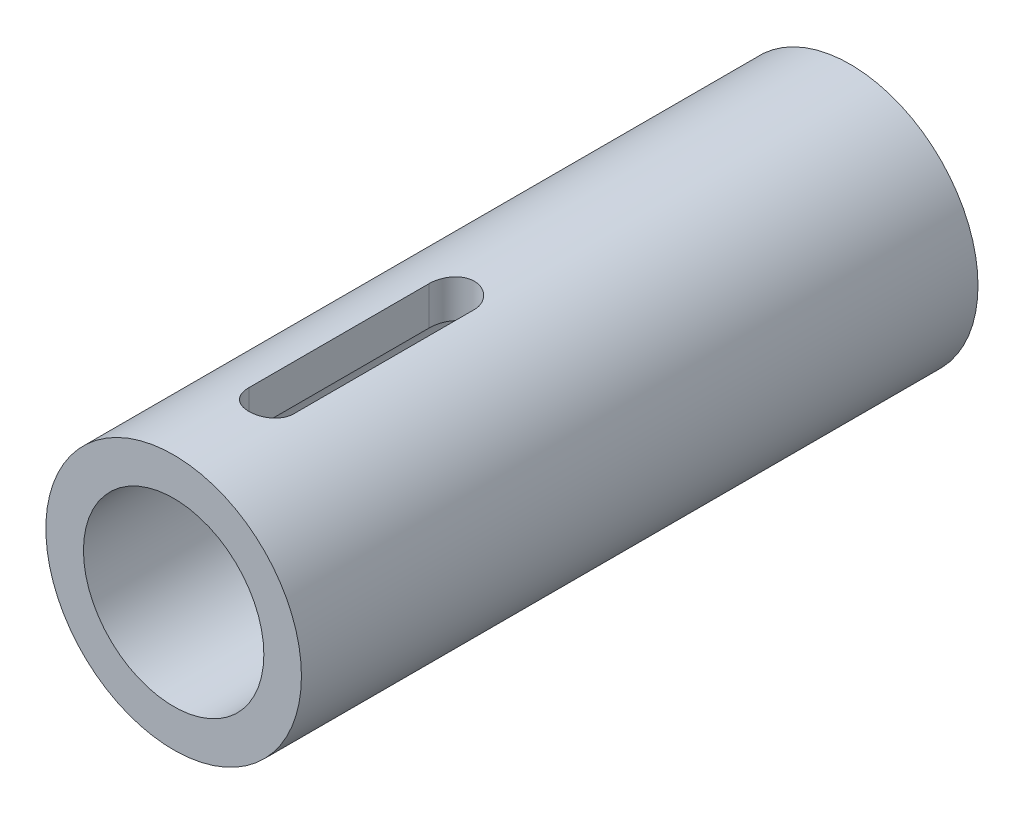
ISO-10303-21;
HEADER;
FILE_DESCRIPTION(('STEP AP214'),'2;1');
FILE_NAME('part.step','',(''),(''),'','','');
FILE_SCHEMA(('AUTOMOTIVE_DESIGN { 1 0 10303 214 1 1 1 1 }'));
ENDSEC;
DATA;
#1=APPLICATION_CONTEXT('core data for automotive mechanical design processes');
#2=APPLICATION_PROTOCOL_DEFINITION('international standard','automotive_design',2000,#1);
#3=PRODUCT_CONTEXT('',#1,'mechanical');
#4=PRODUCT('Part','Part','',(#3));
#5=PRODUCT_RELATED_PRODUCT_CATEGORY('part','',(#4));
#6=PRODUCT_DEFINITION_FORMATION('','',#4);
#7=PRODUCT_DEFINITION_CONTEXT('part definition',#1,'design');
#8=PRODUCT_DEFINITION('design','',#6,#7);
#9=PRODUCT_DEFINITION_SHAPE('','',#8);
#10=(LENGTH_UNIT() NAMED_UNIT(*) SI_UNIT(.MILLI.,.METRE.));
#11=(NAMED_UNIT(*) PLANE_ANGLE_UNIT() SI_UNIT($,.RADIAN.));
#12=(NAMED_UNIT(*) SI_UNIT($,.STERADIAN.) SOLID_ANGLE_UNIT());
#13=UNCERTAINTY_MEASURE_WITH_UNIT(LENGTH_MEASURE(1.E-05),#10,'distance_accuracy_value','');
#14=(GEOMETRIC_REPRESENTATION_CONTEXT(3) GLOBAL_UNCERTAINTY_ASSIGNED_CONTEXT((#13)) GLOBAL_UNIT_ASSIGNED_CONTEXT((#10,
#11,#12)) REPRESENTATION_CONTEXT('',''));
#15=CARTESIAN_POINT('',(0.,0.,0.));
#16=DIRECTION('',(0.,0.,1.));
#17=DIRECTION('',(1.,0.,0.));
#18=AXIS2_PLACEMENT_3D('',#15,#16,#17);
#19=CARTESIAN_POINT('',(0.,0.,45.));
#20=DIRECTION('',(0.,0.,1.));
#21=DIRECTION('',(1.,0.,0.));
#22=AXIS2_PLACEMENT_3D('',#19,#20,#21);
#23=PLANE('',#22);
#24=CARTESIAN_POINT('',(0.,0.,45.));
#25=DIRECTION('',(0.,0.,1.));
#26=DIRECTION('',(1.,0.,0.));
#27=AXIS2_PLACEMENT_3D('',#24,#25,#26);
#28=CIRCLE('',#27,8.5);
#29=CARTESIAN_POINT('',(8.5,0.,45.));
#30=VERTEX_POINT('',#29);
#31=EDGE_CURVE('E11',#30,#30,#28,.T.);
#32=ORIENTED_EDGE('',*,*,#31,.T.);
#33=EDGE_LOOP('',(#32));
#34=FACE_BOUND('',#33,.T.);
#35=CARTESIAN_POINT('',(0.,0.,45.));
#36=DIRECTION('',(0.,0.,1.));
#37=DIRECTION('',(1.,0.,0.));
#38=AXIS2_PLACEMENT_3D('',#35,#36,#37);
#39=CIRCLE('',#38,6.);
#40=CARTESIAN_POINT('',(6.,0.,45.));
#41=VERTEX_POINT('',#40);
#42=EDGE_CURVE('E137',#41,#41,#39,.T.);
#43=ORIENTED_EDGE('',*,*,#42,.F.);
#44=EDGE_LOOP('',(#43));
#45=FACE_BOUND('',#44,.T.);
#46=ADVANCED_FACE('F31',(#34,#45),#23,.T.);
#47=CARTESIAN_POINT('',(0.,0.,0.));
#48=DIRECTION('',(0.,0.,1.));
#49=DIRECTION('',(1.,0.,0.));
#50=AXIS2_PLACEMENT_3D('',#47,#48,#49);
#51=PLANE('',#50);
#52=CARTESIAN_POINT('',(0.,0.,0.));
#53=DIRECTION('',(0.,0.,1.));
#54=DIRECTION('',(1.,0.,0.));
#55=AXIS2_PLACEMENT_3D('',#52,#53,#54);
#56=CIRCLE('',#55,8.5);
#57=CARTESIAN_POINT('',(8.5,0.,0.));
#58=VERTEX_POINT('',#57);
#59=EDGE_CURVE('E35',#58,#58,#56,.T.);
#60=ORIENTED_EDGE('',*,*,#59,.F.);
#61=EDGE_LOOP('',(#60));
#62=FACE_BOUND('',#61,.T.);
#63=CARTESIAN_POINT('',(0.,0.,0.));
#64=DIRECTION('',(0.,0.,1.));
#65=DIRECTION('',(1.,0.,0.));
#66=AXIS2_PLACEMENT_3D('',#63,#64,#65);
#67=CIRCLE('',#66,6.);
#68=CARTESIAN_POINT('',(6.,0.,0.));
#69=VERTEX_POINT('',#68);
#70=EDGE_CURVE('E136',#69,#69,#67,.T.);
#71=ORIENTED_EDGE('',*,*,#70,.T.);
#72=EDGE_LOOP('',(#71));
#73=FACE_BOUND('',#72,.T.);
#74=ADVANCED_FACE('F143',(#62,#73),#51,.F.);
#75=CARTESIAN_POINT('',(0.,0.,45.));
#76=DIRECTION('',(0.,0.,-1.));
#77=DIRECTION('',(-1.,0.,0.));
#78=AXIS2_PLACEMENT_3D('',#75,#76,#77);
#79=CYLINDRICAL_SURFACE('',#78,8.5);
#80=CARTESIAN_POINT('',(1.5,8.36660026534076,26.5));
#81=CARTESIAN_POINT('',(1.50000011135859,8.366598402778,26.4581493818495));
#82=CARTESIAN_POINT('',(1.4982474179413,8.36691467710197,26.4163191412351));
#83=CARTESIAN_POINT('',(1.49125777827606,8.3681640106607,26.3329645220983));
#84=CARTESIAN_POINT('',(1.48602120328377,8.36909700417546,26.2914401114623));
#85=CARTESIAN_POINT('',(1.46514818179087,8.37278645036765,26.1678936386286));
#86=CARTESIAN_POINT('',(1.44434821617835,8.37643353972846,26.0867094820502));
#87=CARTESIAN_POINT('',(1.38960356269488,8.38568796416279,25.9290561356252));
#88=CARTESIAN_POINT('',(1.35565638132934,8.39129567106646,25.8525878433783));
#89=CARTESIAN_POINT('',(1.27560337342705,8.40383672205726,25.7064152438002));
#90=CARTESIAN_POINT('',(1.22949708426408,8.41077011658101,25.636711193971));
#91=CARTESIAN_POINT('',(1.12590102963337,8.42526563496412,25.5053059178189));
#92=CARTESIAN_POINT('',(1.0683044492113,8.43283323966683,25.4436895319723));
#93=CARTESIAN_POINT('',(0.943586837078766,8.44769677126336,25.3309355665241));
#94=CARTESIAN_POINT('',(0.876464344340724,8.45499265626536,25.2797995972922));
#95=CARTESIAN_POINT('',(0.734046276801383,8.46854880703508,25.1891421565387));
#96=CARTESIAN_POINT('',(0.658698947327548,8.47480180537148,25.1497008114296));
#97=CARTESIAN_POINT('',(0.502323494924654,8.48550558844895,25.0840694640184));
#98=CARTESIAN_POINT('',(0.421296106217059,8.48995660561739,25.057877752612));
#99=CARTESIAN_POINT('',(0.256742997836217,8.49651635854217,25.0197492836171));
#100=CARTESIAN_POINT('',(0.173251637296258,8.49864876385664,25.0076683795436));
#101=CARTESIAN_POINT('',(0.00539963868181817,8.500412496163,24.9976557245214));
#102=CARTESIAN_POINT('',(-0.0789609537482993,8.50004395382093,24.9997232343661));
#103=CARTESIAN_POINT('',(-0.245165496187647,8.49686584828589,25.0178376812364));
#104=CARTESIAN_POINT('',(-0.327026991878545,8.49408344494614,25.0337290824281));
#105=CARTESIAN_POINT('',(-0.486902434331634,8.48642063738551,25.0787947030915));
#106=CARTESIAN_POINT('',(-0.564916278540462,8.48154017727773,25.1079692763943));
#107=CARTESIAN_POINT('',(-0.715341078171811,8.47018366749821,25.1789252548035));
#108=CARTESIAN_POINT('',(-0.787721485002882,8.46369962061736,25.2207700895613));
#109=CARTESIAN_POINT('',(-0.92448899546238,8.44985515876235,25.3158307810456));
#110=CARTESIAN_POINT('',(-0.988875661861379,8.44249469589443,25.369047259328));
#111=CARTESIAN_POINT('',(-1.10874335222035,8.42759704414416,25.4861926773927));
#112=CARTESIAN_POINT('',(-1.16409268396565,8.4200588103546,25.5502563027149));
#113=CARTESIAN_POINT('',(-1.26329447706803,8.40574849793007,25.6868507425594));
#114=CARTESIAN_POINT('',(-1.3071436909601,8.39897663601356,25.7593839404262));
#115=CARTESIAN_POINT('',(-1.38213228465011,8.38696375335457,25.9110316240987));
#116=CARTESIAN_POINT('',(-1.41324691775275,8.38172571881351,25.9901585677274));
#117=CARTESIAN_POINT('',(-1.46166112850799,8.37341986972631,26.152576139506));
#118=CARTESIAN_POINT('',(-1.47898133268701,8.37034881572577,26.235860352448));
#119=CARTESIAN_POINT('',(-1.49276888438618,8.36789388231905,26.3498225776212));
#120=CARTESIAN_POINT('',(-1.49548163450041,8.36740923587787,26.3798183824869));
#121=CARTESIAN_POINT('',(-1.49909485472849,8.36676273838412,26.4398717139494));
#122=CARTESIAN_POINT('',(-1.4999983711754,8.36660034473619,26.4699290513493));
#123=CARTESIAN_POINT('',(-1.5,8.36660026534075,26.5));
#124=B_SPLINE_CURVE_WITH_KNOTS('',3,(#80,#81,#82,#83,#84,#85,#86,#87,#88,#89,#90,#91,#92,#93,
#94,#95,#96,#97,#98,#99,#100,#101,#102,#103,#104,#105,#106,#107,#108,#109,#110,#111,#112,#113,
#114,#115,#116,#117,#118,#119,#120,#121,#122,#123),.UNSPECIFIED.,.F.,.F.,(4,2,2,2,2,2,2,2,2,2,2,
2,2,2,2,2,2,2,2,2,2,4),(0.,0.125473687190875,0.250934005570584,0.501295383099465,
0.751704267317939,1.00212268039609,1.25498766631627,1.50789147715663,1.76249002695643,
2.01705572705567,2.26899756033392,2.52092623060524,2.77005652657743,3.0191934591585,
3.26959883743158,3.52001790596794,3.77381131576282,4.02767631612482,4.28203232814816,
4.53600728901199,4.62633117846913,4.71650285497248),.UNSPECIFIED.);
#125=CARTESIAN_POINT('',(1.5,8.36660026534075,26.5));
#126=VERTEX_POINT('',#125);
#127=CARTESIAN_POINT('',(-1.5,8.36660026534076,26.5));
#128=VERTEX_POINT('',#127);
#129=EDGE_CURVE('E78',#126,#128,#124,.T.);
#130=ORIENTED_EDGE('',*,*,#129,.F.);
#131=DIRECTION('',(0.,0.,-1.));
#132=VECTOR('',#131,1.);
#133=CARTESIAN_POINT('',(1.5,8.36660026534075,45.));
#134=LINE('',#133,#132);
#135=CARTESIAN_POINT('',(1.5,8.36660026534075,38.5));
#136=VERTEX_POINT('',#135);
#137=EDGE_CURVE('E86',#136,#126,#134,.T.);
#138=ORIENTED_EDGE('',*,*,#137,.F.);
#139=CARTESIAN_POINT('',(-1.5,8.36660026534076,38.5));
#140=CARTESIAN_POINT('',(-1.50000011135859,8.366598402778,38.5418506181505));
#141=CARTESIAN_POINT('',(-1.4982474179413,8.36691467710197,38.5836808587649));
#142=CARTESIAN_POINT('',(-1.49125777827606,8.3681640106607,38.6670354779017));
#143=CARTESIAN_POINT('',(-1.48602120328377,8.36909700417546,38.7085598885377));
#144=CARTESIAN_POINT('',(-1.46514818179087,8.37278645036765,38.8321063613714));
#145=CARTESIAN_POINT('',(-1.44434821617835,8.37643353972846,38.9132905179498));
#146=CARTESIAN_POINT('',(-1.38960356269488,8.38568796416279,39.0709438643748));
#147=CARTESIAN_POINT('',(-1.35565638132935,8.39129567106646,39.1474121566217));
#148=CARTESIAN_POINT('',(-1.27560337342705,8.40383672205726,39.2935847561998));
#149=CARTESIAN_POINT('',(-1.22949708426408,8.41077011658101,39.363288806029));
#150=CARTESIAN_POINT('',(-1.12590102963337,8.42526563496412,39.4946940821811));
#151=CARTESIAN_POINT('',(-1.0683044492113,8.43283323966683,39.5563104680277));
#152=CARTESIAN_POINT('',(-0.943586837078763,8.44769677126336,39.6690644334759));
#153=CARTESIAN_POINT('',(-0.876464344340719,8.45499265626536,39.7202004027078));
#154=CARTESIAN_POINT('',(-0.734046276801379,8.46854880703508,39.8108578434613));
#155=CARTESIAN_POINT('',(-0.658698947327544,8.47480180537148,39.8502991885704));
#156=CARTESIAN_POINT('',(-0.502323494924653,8.48550558844895,39.9159305359816));
#157=CARTESIAN_POINT('',(-0.421296106217059,8.48995660561739,39.942122247388));
#158=CARTESIAN_POINT('',(-0.256742997836217,8.49651635854217,39.9802507163829));
#159=CARTESIAN_POINT('',(-0.173251637296258,8.49864876385664,39.9923316204564));
#160=CARTESIAN_POINT('',(-0.00539963868181676,8.500412496163,40.0023442754786));
#161=CARTESIAN_POINT('',(0.0789609537483017,8.50004395382093,40.0002767656339));
#162=CARTESIAN_POINT('',(0.245165496187651,8.49686584828589,39.9821623187636));
#163=CARTESIAN_POINT('',(0.327026991878549,8.49408344494614,39.9662709175719));
#164=CARTESIAN_POINT('',(0.486902434331638,8.48642063738551,39.9212052969085));
#165=CARTESIAN_POINT('',(0.564916278540465,8.48154017727773,39.8920307236057));
#166=CARTESIAN_POINT('',(0.715341078171813,8.47018366749821,39.8210747451965));
#167=CARTESIAN_POINT('',(0.787721485002885,8.46369962061736,39.7792299104387));
#168=CARTESIAN_POINT('',(0.924488995462384,8.44985515876235,39.6841692189544));
#169=CARTESIAN_POINT('',(0.988875661861384,8.44249469589442,39.630952740672));
#170=CARTESIAN_POINT('',(1.10874335222035,8.42759704414415,39.5138073226073));
#171=CARTESIAN_POINT('',(1.16409268396565,8.4200588103546,39.4497436972851));
#172=CARTESIAN_POINT('',(1.26329447706803,8.40574849793007,39.3131492574406));
#173=CARTESIAN_POINT('',(1.3071436909601,8.39897663601356,39.2406160595738));
#174=CARTESIAN_POINT('',(1.38213228465011,8.38696375335457,39.0889683759013));
#175=CARTESIAN_POINT('',(1.41324691775275,8.38172571881351,39.0098414322726));
#176=CARTESIAN_POINT('',(1.46166112850799,8.37341986972631,38.847423860494));
#177=CARTESIAN_POINT('',(1.47898133268701,8.37034881572577,38.764139647552));
#178=CARTESIAN_POINT('',(1.49276888438618,8.36789388231905,38.6501774223788));
#179=CARTESIAN_POINT('',(1.49548163450041,8.36740923587787,38.6201816175131));
#180=CARTESIAN_POINT('',(1.49909485472849,8.36676273838412,38.5601282860505));
#181=CARTESIAN_POINT('',(1.4999983711754,8.36660034473619,38.5300709486507));
#182=CARTESIAN_POINT('',(1.5,8.36660026534075,38.5));
#183=B_SPLINE_CURVE_WITH_KNOTS('',3,(#139,#140,#141,#142,#143,#144,#145,#146,#147,#148,#149,
#150,#151,#152,#153,#154,#155,#156,#157,#158,#159,#160,#161,#162,#163,#164,#165,#166,#167,#168,
#169,#170,#171,#172,#173,#174,#175,#176,#177,#178,#179,#180,#181,#182),.UNSPECIFIED.,.F.,.F.,(4,
2,2,2,2,2,2,2,2,2,2,2,2,2,2,2,2,2,2,2,2,4),(0.,0.125473687190871,0.250934005570585,
0.501295383099468,0.751704267317934,1.00212268039609,1.25498766631627,1.50789147715664,
1.76249002695644,2.01705572705567,2.26899756033392,2.52092623060524,2.77005652657743,
3.0191934591585,3.26959883743159,3.52001790596794,3.77381131576283,4.02767631612483,
4.28203232814817,4.536007289012,4.62633117846913,4.71650285497248),.UNSPECIFIED.);
#184=CARTESIAN_POINT('',(-1.5,8.36660026534076,38.5));
#185=VERTEX_POINT('',#184);
#186=EDGE_CURVE('E90',#185,#136,#183,.T.);
#187=ORIENTED_EDGE('',*,*,#186,.F.);
#188=DIRECTION('',(0.,0.,-1.));
#189=VECTOR('',#188,1.);
#190=CARTESIAN_POINT('',(-1.5,8.36660026534075,45.));
#191=LINE('',#190,#189);
#192=EDGE_CURVE('E46',#128,#185,#191,.F.);
#193=ORIENTED_EDGE('',*,*,#192,.F.);
#194=EDGE_LOOP('',(#130,#138,#187,#193));
#195=FACE_BOUND('',#194,.T.);
#196=ORIENTED_EDGE('',*,*,#31,.F.);
#197=EDGE_LOOP('',(#196));
#198=FACE_BOUND('',#197,.T.);
#199=ORIENTED_EDGE('',*,*,#59,.T.);
#200=EDGE_LOOP('',(#199));
#201=FACE_BOUND('',#200,.T.);
#202=ADVANCED_FACE('F33',(#195,#198,#201),#79,.T.);
#203=CARTESIAN_POINT('',(0.,0.,45.));
#204=DIRECTION('',(0.,0.,-1.));
#205=DIRECTION('',(-1.,0.,0.));
#206=AXIS2_PLACEMENT_3D('',#203,#204,#205);
#207=CYLINDRICAL_SURFACE('',#206,6.);
#208=DIRECTION('',(0.,0.,-1.));
#209=VECTOR('',#208,1.);
#210=CARTESIAN_POINT('',(1.5,5.80947501931113,45.));
#211=LINE('',#210,#209);
#212=CARTESIAN_POINT('',(1.5,5.80947501931113,38.5));
#213=VERTEX_POINT('',#212);
#214=CARTESIAN_POINT('',(1.5,5.80947501931113,26.5));
#215=VERTEX_POINT('',#214);
#216=EDGE_CURVE('E132',#213,#215,#211,.T.);
#217=ORIENTED_EDGE('',*,*,#216,.T.);
#218=CARTESIAN_POINT('',(1.5,5.80947501931113,26.5));
#219=CARTESIAN_POINT('',(1.50000050624417,5.80947222870266,26.4585055223402));
#220=CARTESIAN_POINT('',(1.49827711106305,5.80992014924206,26.4170316054727));
#221=CARTESIAN_POINT('',(1.49140694309363,5.81168857161838,26.3343939470447));
#222=CARTESIAN_POINT('',(1.48626074635902,5.8130089266253,26.2932301544694));
#223=CARTESIAN_POINT('',(1.46576285907379,5.81822566458081,26.1708202401867));
#224=CARTESIAN_POINT('',(1.44535154275874,5.82337804723214,26.0904152972767));
#225=CARTESIAN_POINT('',(1.39169711437199,5.83643133882004,25.934312989327));
#226=CARTESIAN_POINT('',(1.35845520813575,5.84433198946395,25.8586151826807));
#227=CARTESIAN_POINT('',(1.2801230670388,5.86198701707909,25.713832827029));
#228=CARTESIAN_POINT('',(1.2350296550354,5.87174189093471,25.6447500581635));
#229=CARTESIAN_POINT('',(1.1332267077421,5.89224393597038,25.5136841771408));
#230=CARTESIAN_POINT('',(1.07630590317596,5.90300686543374,25.4518676706317));
#231=CARTESIAN_POINT('',(0.952913670774344,5.9241765659429,25.3385468657759));
#232=CARTESIAN_POINT('',(0.886440719218247,5.93458327983806,25.2870442157981));
#233=CARTESIAN_POINT('',(0.744685349102537,5.95404273424872,25.195133497572));
#234=CARTESIAN_POINT('',(0.669293010501711,5.96307457022596,25.154890156024));
#235=CARTESIAN_POINT('',(0.512553886264378,5.97858519375883,25.0877128987049));
#236=CARTESIAN_POINT('',(0.431208276124513,5.98506448372051,25.0607763635503));
#237=CARTESIAN_POINT('',(0.266616162787738,5.99462850007692,25.0215115108338));
#238=CARTESIAN_POINT('',(0.183441483004285,5.99777929351951,25.0088984913658));
#239=CARTESIAN_POINT('',(0.016099163522518,6.00056157226223,24.9977449426851));
#240=CARTESIAN_POINT('',(-0.0680683500430595,6.00019349990167,24.9992026447115));
#241=CARTESIAN_POINT('',(-0.233028739458145,5.99602856048604,25.0159449455282));
#242=CARTESIAN_POINT('',(-0.313855052609783,5.99230798016041,25.0309219248992));
#243=CARTESIAN_POINT('',(-0.47180806662651,5.98194495954744,25.0737830187741));
#244=CARTESIAN_POINT('',(-0.548934603635982,5.97530238998334,25.1016677043529));
#245=CARTESIAN_POINT('',(-0.69811092903681,5.95972496642698,25.169801921006));
#246=CARTESIAN_POINT('',(-0.770108444403374,5.95076990741333,25.2101610913493));
#247=CARTESIAN_POINT('',(-0.906414946845023,5.93153918312879,25.3020146947502));
#248=CARTESIAN_POINT('',(-0.970722773343435,5.92126331899798,25.3535108053798));
#249=CARTESIAN_POINT('',(-1.09165408456274,5.90018349034298,25.467818368122));
#250=CARTESIAN_POINT('',(-1.14802365458119,5.88937275716528,25.5308974548097));
#251=CARTESIAN_POINT('',(-1.24945436277936,5.8686925242601,25.6657448003916));
#252=CARTESIAN_POINT('',(-1.29451240536759,5.8588232826449,25.7375154299253));
#253=CARTESIAN_POINT('',(-1.37220706392894,5.84111720379488,25.8882183967356));
#254=CARTESIAN_POINT('',(-1.4047755268309,5.83329159013705,25.9671871973441));
#255=CARTESIAN_POINT('',(-1.45605352777474,5.82070588210583,26.1296753926274));
#256=CARTESIAN_POINT('',(-1.4747837838182,5.81594120642153,26.2131877827248));
#257=CARTESIAN_POINT('',(-1.49085695272641,5.81182936022286,26.3311860711384));
#258=CARTESIAN_POINT('',(-1.49428618645006,5.81094784666289,26.3648795548198));
#259=CARTESIAN_POINT('',(-1.49885513654609,5.80977093733462,26.432376684864));
#260=CARTESIAN_POINT('',(-1.49999855714407,5.80947459329191,26.4661800639329));
#261=CARTESIAN_POINT('',(-1.5,5.80947501931113,26.5));
#262=B_SPLINE_CURVE_WITH_KNOTS('',3,(#218,#219,#220,#221,#222,#223,#224,#225,#226,#227,#228,
#229,#230,#231,#232,#233,#234,#235,#236,#237,#238,#239,#240,#241,#242,#243,#244,#245,#246,#247,
#248,#249,#250,#251,#252,#253,#254,#255,#256,#257,#258,#259,#260,#261),.UNSPECIFIED.,.F.,.F.,(4,
2,2,2,2,2,2,2,2,2,2,2,2,2,2,2,2,2,2,2,2,4),(0.,0.124404795509654,0.248788659126978,
0.496844944620475,0.74487792313725,0.992977462090123,1.24596284614196,1.49898863030879,
1.75554280647352,2.01204646098637,2.26335722272987,2.51463639384958,2.76033818218913,
3.00605084213757,3.25398764175565,3.50196181446493,3.75662144301813,4.01135068771451,
4.26745080241601,4.52316671309979,4.62473773083972,4.72614401597507),.UNSPECIFIED.);
#263=CARTESIAN_POINT('',(-1.5,5.80947501931113,26.5));
#264=VERTEX_POINT('',#263);
#265=EDGE_CURVE('E80',#215,#264,#262,.T.);
#266=ORIENTED_EDGE('',*,*,#265,.T.);
#267=DIRECTION('',(0.,0.,-1.));
#268=VECTOR('',#267,1.);
#269=CARTESIAN_POINT('',(-1.5,5.80947501931113,45.));
#270=LINE('',#269,#268);
#271=CARTESIAN_POINT('',(-1.5,5.80947501931113,38.5));
#272=VERTEX_POINT('',#271);
#273=EDGE_CURVE('E94',#264,#272,#270,.F.);
#274=ORIENTED_EDGE('',*,*,#273,.T.);
#275=CARTESIAN_POINT('',(-1.5,5.80947501931113,38.5));
#276=CARTESIAN_POINT('',(-1.50000050624417,5.80947222870266,38.5414944776598));
#277=CARTESIAN_POINT('',(-1.49827711106305,5.80992014924206,38.5829683945273));
#278=CARTESIAN_POINT('',(-1.49140694309363,5.81168857161838,38.6656060529553));
#279=CARTESIAN_POINT('',(-1.48626074635902,5.8130089266253,38.7067698455306));
#280=CARTESIAN_POINT('',(-1.46576285907379,5.81822566458081,38.8291797598133));
#281=CARTESIAN_POINT('',(-1.44535154275874,5.82337804723213,38.9095847027233));
#282=CARTESIAN_POINT('',(-1.391697114372,5.83643133882004,39.065687010673));
#283=CARTESIAN_POINT('',(-1.35845520813576,5.84433198946395,39.1413848173193));
#284=CARTESIAN_POINT('',(-1.2801230670388,5.86198701707909,39.286167172971));
#285=CARTESIAN_POINT('',(-1.2350296550354,5.8717418909347,39.3552499418364));
#286=CARTESIAN_POINT('',(-1.13322670774211,5.89224393597038,39.4863158228591));
#287=CARTESIAN_POINT('',(-1.07630590317596,5.90300686543374,39.5481323293683));
#288=CARTESIAN_POINT('',(-0.952913670774346,5.9241765659429,39.6614531342241));
#289=CARTESIAN_POINT('',(-0.886440719218248,5.93458327983806,39.7129557842019));
#290=CARTESIAN_POINT('',(-0.744685349102537,5.95404273424872,39.804866502428));
#291=CARTESIAN_POINT('',(-0.669293010501711,5.96307457022596,39.845109843976));
#292=CARTESIAN_POINT('',(-0.512553886264379,5.97858519375883,39.9122871012951));
#293=CARTESIAN_POINT('',(-0.431208276124515,5.98506448372051,39.9392236364498));
#294=CARTESIAN_POINT('',(-0.266616162787741,5.99462850007692,39.9784884891662));
#295=CARTESIAN_POINT('',(-0.183441483004287,5.99777929351951,39.9911015086342));
#296=CARTESIAN_POINT('',(-0.0160991635225193,6.00056157226223,40.0022550573149));
#297=CARTESIAN_POINT('',(0.0680683500430588,6.00019349990167,40.0007973552885));
#298=CARTESIAN_POINT('',(0.233028739458145,5.99602856048604,39.9840550544718));
#299=CARTESIAN_POINT('',(0.313855052609783,5.99230798016041,39.9690780751008));
#300=CARTESIAN_POINT('',(0.47180806662651,5.98194495954744,39.9262169812259));
#301=CARTESIAN_POINT('',(0.548934603635981,5.97530238998334,39.8983322956471));
#302=CARTESIAN_POINT('',(0.698110929036808,5.95972496642698,39.830198078994));
#303=CARTESIAN_POINT('',(0.770108444403372,5.95076990741333,39.7898389086507));
#304=CARTESIAN_POINT('',(0.90641494684502,5.93153918312879,39.6979853052498));
#305=CARTESIAN_POINT('',(0.970722773343431,5.92126331899798,39.6464891946202));
#306=CARTESIAN_POINT('',(1.09165408456273,5.90018349034298,39.532181631878));
#307=CARTESIAN_POINT('',(1.14802365458119,5.88937275716528,39.4691025451903));
#308=CARTESIAN_POINT('',(1.24945436277936,5.8686925242601,39.3342551996084));
#309=CARTESIAN_POINT('',(1.29451240536759,5.8588232826449,39.2624845700747));
#310=CARTESIAN_POINT('',(1.37220706392894,5.84111720379488,39.1117816032644));
#311=CARTESIAN_POINT('',(1.4047755268309,5.83329159013705,39.0328128026559));
#312=CARTESIAN_POINT('',(1.45605352777474,5.82070588210583,38.8703246073726));
#313=CARTESIAN_POINT('',(1.4747837838182,5.81594120642153,38.7868122172752));
#314=CARTESIAN_POINT('',(1.49085695272641,5.81182936022286,38.6688139288617));
#315=CARTESIAN_POINT('',(1.49428618645006,5.8109478466629,38.6351204451802));
#316=CARTESIAN_POINT('',(1.49885513654609,5.80977093733462,38.567623315136));
#317=CARTESIAN_POINT('',(1.49999855714407,5.80947459329191,38.5338199360671));
#318=CARTESIAN_POINT('',(1.5,5.80947501931113,38.5));
#319=B_SPLINE_CURVE_WITH_KNOTS('',3,(#275,#276,#277,#278,#279,#280,#281,#282,#283,#284,#285,
#286,#287,#288,#289,#290,#291,#292,#293,#294,#295,#296,#297,#298,#299,#300,#301,#302,#303,#304,
#305,#306,#307,#308,#309,#310,#311,#312,#313,#314,#315,#316,#317,#318),.UNSPECIFIED.,.F.,.F.,(4,
2,2,2,2,2,2,2,2,2,2,2,2,2,2,2,2,2,2,2,2,4),(0.,0.124404795509657,0.248788659126974,
0.496844944620475,0.744877923137246,0.992977462090122,1.24596284614196,1.49898863030879,
1.75554280647352,2.01204646098637,2.26335722272987,2.51463639384959,2.76033818218914,
3.00605084213757,3.25398764175564,3.50196181446493,3.75662144301814,4.01135068771451,
4.267450802416,4.52316671309978,4.62473773083972,4.72614401597506),.UNSPECIFIED.);
#320=EDGE_CURVE('E123',#272,#213,#319,.T.);
#321=ORIENTED_EDGE('',*,*,#320,.T.);
#322=EDGE_LOOP('',(#217,#266,#274,#321));
#323=FACE_BOUND('',#322,.T.);
#324=ORIENTED_EDGE('',*,*,#42,.T.);
#325=EDGE_LOOP('',(#324));
#326=FACE_BOUND('',#325,.T.);
#327=ORIENTED_EDGE('',*,*,#70,.F.);
#328=EDGE_LOOP('',(#327));
#329=FACE_BOUND('',#328,.T.);
#330=ADVANCED_FACE('F119',(#323,#326,#329),#207,.F.);
#331=CARTESIAN_POINT('',(1.5,-8.501,38.5));
#332=DIRECTION('',(1.,0.,0.));
#333=DIRECTION('',(0.,0.,-1.));
#334=AXIS2_PLACEMENT_3D('',#331,#332,#333);
#335=PLANE('',#334);
#336=ORIENTED_EDGE('',*,*,#137,.T.);
#337=DIRECTION('',(0.,1.,0.));
#338=VECTOR('',#337,1.);
#339=CARTESIAN_POINT('',(1.5,-8.501,26.5));
#340=LINE('',#339,#338);
#341=EDGE_CURVE('E73',#215,#126,#340,.T.);
#342=ORIENTED_EDGE('',*,*,#341,.F.);
#343=ORIENTED_EDGE('',*,*,#216,.F.);
#344=DIRECTION('',(0.,1.,0.));
#345=VECTOR('',#344,1.);
#346=CARTESIAN_POINT('',(1.5,-8.501,38.5));
#347=LINE('',#346,#345);
#348=EDGE_CURVE('E54',#213,#136,#347,.T.);
#349=ORIENTED_EDGE('',*,*,#348,.T.);
#350=EDGE_LOOP('',(#336,#342,#343,#349));
#351=FACE_BOUND('',#350,.T.);
#352=ADVANCED_FACE('F87',(#351),#335,.F.);
#353=CARTESIAN_POINT('',(0.,-8.501,26.5));
#354=DIRECTION('',(0.,1.,0.));
#355=DIRECTION('',(0.,0.,1.));
#356=AXIS2_PLACEMENT_3D('',#353,#354,#355);
#357=CYLINDRICAL_SURFACE('',#356,1.5);
#358=ORIENTED_EDGE('',*,*,#129,.T.);
#359=DIRECTION('',(0.,1.,0.));
#360=VECTOR('',#359,1.);
#361=CARTESIAN_POINT('',(-1.5,-8.501,26.5));
#362=LINE('',#361,#360);
#363=EDGE_CURVE('E83',#264,#128,#362,.T.);
#364=ORIENTED_EDGE('',*,*,#363,.F.);
#365=ORIENTED_EDGE('',*,*,#265,.F.);
#366=ORIENTED_EDGE('',*,*,#341,.T.);
#367=EDGE_LOOP('',(#358,#364,#365,#366));
#368=FACE_BOUND('',#367,.T.);
#369=ADVANCED_FACE('F75',(#368),#357,.F.);
#370=CARTESIAN_POINT('',(-1.5,-8.501,38.5));
#371=DIRECTION('',(-1.,0.,0.));
#372=DIRECTION('',(0.,0.,1.));
#373=AXIS2_PLACEMENT_3D('',#370,#371,#372);
#374=PLANE('',#373);
#375=ORIENTED_EDGE('',*,*,#192,.T.);
#376=DIRECTION('',(0.,1.,0.));
#377=VECTOR('',#376,1.);
#378=CARTESIAN_POINT('',(-1.5,-8.501,38.5));
#379=LINE('',#378,#377);
#380=EDGE_CURVE('E130',#272,#185,#379,.T.);
#381=ORIENTED_EDGE('',*,*,#380,.F.);
#382=ORIENTED_EDGE('',*,*,#273,.F.);
#383=ORIENTED_EDGE('',*,*,#363,.T.);
#384=EDGE_LOOP('',(#375,#381,#382,#383));
#385=FACE_BOUND('',#384,.T.);
#386=ADVANCED_FACE('F109',(#385),#374,.F.);
#387=CARTESIAN_POINT('',(0.,-8.501,38.5));
#388=DIRECTION('',(0.,1.,0.));
#389=DIRECTION('',(0.,0.,1.));
#390=AXIS2_PLACEMENT_3D('',#387,#388,#389);
#391=CYLINDRICAL_SURFACE('',#390,1.5);
#392=ORIENTED_EDGE('',*,*,#186,.T.);
#393=ORIENTED_EDGE('',*,*,#348,.F.);
#394=ORIENTED_EDGE('',*,*,#320,.F.);
#395=ORIENTED_EDGE('',*,*,#380,.T.);
#396=EDGE_LOOP('',(#392,#393,#394,#395));
#397=FACE_BOUND('',#396,.T.);
#398=ADVANCED_FACE('F115',(#397),#391,.F.);
#399=CLOSED_SHELL('',(#46,#74,#202,#330,#352,#369,#386,#398));
#400=MANIFOLD_SOLID_BREP('B2',#399);
#401=ADVANCED_BREP_SHAPE_REPRESENTATION('',(#18,#400),#14);
#402=SHAPE_DEFINITION_REPRESENTATION(#9,#401);
ENDSEC;
END-ISO-10303-21;
